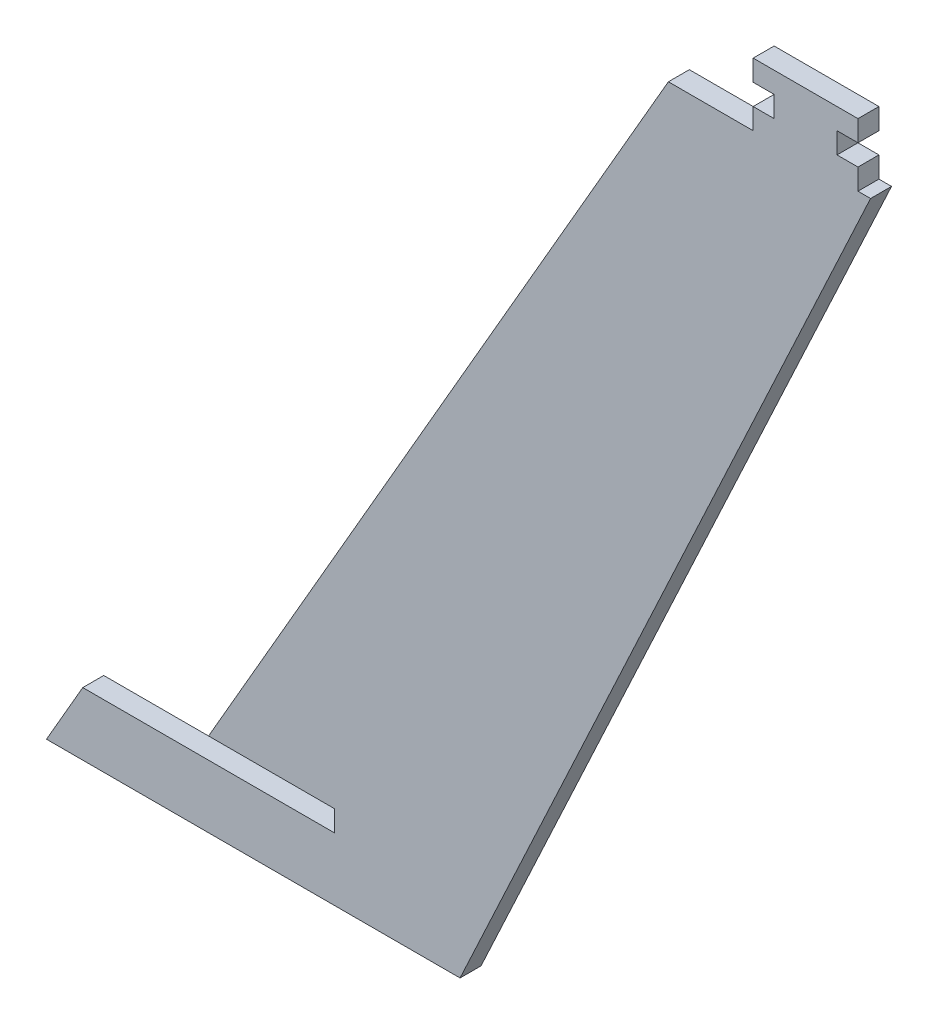
ISO-10303-21;
HEADER;
FILE_DESCRIPTION(('STEP AP214'),'2;1');
FILE_NAME('part.step','',(''),(''),'','','');
FILE_SCHEMA(('AUTOMOTIVE_DESIGN { 1 0 10303 214 1 1 1 1 }'));
ENDSEC;
DATA;
#1=APPLICATION_CONTEXT('core data for automotive mechanical design processes');
#2=APPLICATION_PROTOCOL_DEFINITION('international standard','automotive_design',2000,#1);
#3=PRODUCT_CONTEXT('',#1,'mechanical');
#4=PRODUCT('Part','Part','',(#3));
#5=PRODUCT_RELATED_PRODUCT_CATEGORY('part','',(#4));
#6=PRODUCT_DEFINITION_FORMATION('','',#4);
#7=PRODUCT_DEFINITION_CONTEXT('part definition',#1,'design');
#8=PRODUCT_DEFINITION('design','',#6,#7);
#9=PRODUCT_DEFINITION_SHAPE('','',#8);
#10=(LENGTH_UNIT() NAMED_UNIT(*) SI_UNIT(.MILLI.,.METRE.));
#11=(NAMED_UNIT(*) PLANE_ANGLE_UNIT() SI_UNIT($,.RADIAN.));
#12=(NAMED_UNIT(*) SI_UNIT($,.STERADIAN.) SOLID_ANGLE_UNIT());
#13=UNCERTAINTY_MEASURE_WITH_UNIT(LENGTH_MEASURE(1.E-05),#10,'distance_accuracy_value','');
#14=(GEOMETRIC_REPRESENTATION_CONTEXT(3) GLOBAL_UNCERTAINTY_ASSIGNED_CONTEXT((#13)) GLOBAL_UNIT_ASSIGNED_CONTEXT((#10,
#11,#12)) REPRESENTATION_CONTEXT('',''));
#15=CARTESIAN_POINT('',(0.,0.,0.));
#16=DIRECTION('',(0.,0.,1.));
#17=DIRECTION('',(1.,0.,0.));
#18=AXIS2_PLACEMENT_3D('',#15,#16,#17);
#19=CARTESIAN_POINT('',(69.919223084874,225.,-0.00100000000000013));
#20=DIRECTION('',(1.,0.,0.));
#21=DIRECTION('',(0.,0.,-1.));
#22=AXIS2_PLACEMENT_3D('',#19,#20,#21);
#23=PLANE('',#22);
#24=DIRECTION('',(0.,1.,0.));
#25=VECTOR('',#24,1.);
#26=CARTESIAN_POINT('',(69.919223084874,225.,0.));
#27=LINE('',#26,#25);
#28=CARTESIAN_POINT('',(69.919223084874,220.,0.));
#29=VERTEX_POINT('',#28);
#30=CARTESIAN_POINT('',(69.919223084874,225.,0.));
#31=VERTEX_POINT('',#30);
#32=EDGE_CURVE('E188',#29,#31,#27,.T.);
#33=ORIENTED_EDGE('',*,*,#32,.F.);
#34=DIRECTION('',(0.,0.,1.));
#35=VECTOR('',#34,1.);
#36=CARTESIAN_POINT('',(69.919223084874,220.,-0.00100000000000013));
#37=LINE('',#36,#35);
#38=CARTESIAN_POINT('',(69.919223084874,220.,5.));
#39=VERTEX_POINT('',#38);
#40=EDGE_CURVE('E172',#29,#39,#37,.T.);
#41=ORIENTED_EDGE('',*,*,#40,.T.);
#42=DIRECTION('',(0.,1.,0.));
#43=VECTOR('',#42,1.);
#44=CARTESIAN_POINT('',(69.919223084874,225.,5.));
#45=LINE('',#44,#43);
#46=CARTESIAN_POINT('',(69.919223084874,225.,5.));
#47=VERTEX_POINT('',#46);
#48=EDGE_CURVE('E200',#39,#47,#45,.T.);
#49=ORIENTED_EDGE('',*,*,#48,.T.);
#50=DIRECTION('',(0.,0.,1.));
#51=VECTOR('',#50,1.);
#52=CARTESIAN_POINT('',(69.919223084874,225.,-0.00100000000000013));
#53=LINE('',#52,#51);
#54=EDGE_CURVE('E194',#31,#47,#53,.T.);
#55=ORIENTED_EDGE('',*,*,#54,.F.);
#56=EDGE_LOOP('',(#33,#41,#49,#55));
#57=FACE_BOUND('',#56,.T.);
#58=ADVANCED_FACE('F35',(#57),#23,.F.);
#59=CARTESIAN_POINT('',(94.919223084874,225.,-0.00100000000000013));
#60=DIRECTION('',(-1.,0.,0.));
#61=DIRECTION('',(0.,0.,1.));
#62=AXIS2_PLACEMENT_3D('',#59,#60,#61);
#63=PLANE('',#62);
#64=DIRECTION('',(0.,-1.,0.));
#65=VECTOR('',#64,1.);
#66=CARTESIAN_POINT('',(94.919223084874,225.,5.));
#67=LINE('',#66,#65);
#68=CARTESIAN_POINT('',(94.919223084874,225.,5.));
#69=VERTEX_POINT('',#68);
#70=CARTESIAN_POINT('',(94.919223084874,220.,5.));
#71=VERTEX_POINT('',#70);
#72=EDGE_CURVE('E343',#69,#71,#67,.T.);
#73=ORIENTED_EDGE('',*,*,#72,.T.);
#74=DIRECTION('',(0.,0.,1.));
#75=VECTOR('',#74,1.);
#76=CARTESIAN_POINT('',(94.919223084874,220.,-0.00100000000000013));
#77=LINE('',#76,#75);
#78=CARTESIAN_POINT('',(94.919223084874,220.,0.));
#79=VERTEX_POINT('',#78);
#80=EDGE_CURVE('E330',#79,#71,#77,.T.);
#81=ORIENTED_EDGE('',*,*,#80,.F.);
#82=DIRECTION('',(0.,-1.,0.));
#83=VECTOR('',#82,1.);
#84=CARTESIAN_POINT('',(94.919223084874,225.,0.));
#85=LINE('',#84,#83);
#86=CARTESIAN_POINT('',(94.919223084874,225.,0.));
#87=VERTEX_POINT('',#86);
#88=EDGE_CURVE('E339',#87,#79,#85,.T.);
#89=ORIENTED_EDGE('',*,*,#88,.F.);
#90=DIRECTION('',(0.,0.,1.));
#91=VECTOR('',#90,1.);
#92=CARTESIAN_POINT('',(94.919223084874,225.,-0.00100000000000013));
#93=LINE('',#92,#91);
#94=EDGE_CURVE('E349',#87,#69,#93,.T.);
#95=ORIENTED_EDGE('',*,*,#94,.T.);
#96=EDGE_LOOP('',(#73,#81,#89,#95));
#97=FACE_BOUND('',#96,.T.);
#98=ADVANCED_FACE('F374',(#97),#63,.F.);
#99=CARTESIAN_POINT('',(104.919223084874,225.,5.));
#100=DIRECTION('',(-0.906307787036651,0.422618261740697,0.));
#101=DIRECTION('',(-0.422618261740697,-0.906307787036651,0.));
#102=AXIS2_PLACEMENT_3D('',#99,#100,#101);
#103=PLANE('',#102);
#104=DIRECTION('',(0.422618261740697,0.906307787036651,0.));
#105=VECTOR('',#104,1.);
#106=CARTESIAN_POINT('',(104.919223084874,225.,0.));
#107=LINE('',#106,#105);
#108=CARTESIAN_POINT('',(0.,0.,0.));
#109=VERTEX_POINT('',#108);
#110=CARTESIAN_POINT('',(97.9246082125491,210.,0.));
#111=VERTEX_POINT('',#110);
#112=EDGE_CURVE('E236',#109,#111,#107,.T.);
#113=ORIENTED_EDGE('',*,*,#112,.T.);
#114=DIRECTION('',(0.,0.,-1.));
#115=VECTOR('',#114,1.);
#116=CARTESIAN_POINT('',(97.924608212549,210.,-0.00100000000000013));
#117=LINE('',#116,#115);
#118=CARTESIAN_POINT('',(97.924608212549,210.,5.));
#119=VERTEX_POINT('',#118);
#120=EDGE_CURVE('E214',#119,#111,#117,.T.);
#121=ORIENTED_EDGE('',*,*,#120,.F.);
#122=DIRECTION('',(0.422618261740697,0.906307787036651,0.));
#123=VECTOR('',#122,1.);
#124=CARTESIAN_POINT('',(104.919223084874,225.,5.));
#125=LINE('',#124,#123);
#126=CARTESIAN_POINT('',(0.,0.,5.));
#127=VERTEX_POINT('',#126);
#128=EDGE_CURVE('E216',#127,#119,#125,.T.);
#129=ORIENTED_EDGE('',*,*,#128,.F.);
#130=DIRECTION('',(0.,0.,-1.));
#131=VECTOR('',#130,1.);
#132=CARTESIAN_POINT('',(0.,0.,5.));
#133=LINE('',#132,#131);
#134=EDGE_CURVE('E235',#127,#109,#133,.T.);
#135=ORIENTED_EDGE('',*,*,#134,.T.);
#136=EDGE_LOOP('',(#113,#121,#129,#135));
#137=FACE_BOUND('',#136,.T.);
#138=ADVANCED_FACE('F37',(#137),#103,.F.);
#139=CARTESIAN_POINT('',(58.3568051838745,225.,5.));
#140=DIRECTION('',(0.,-1.,0.));
#141=DIRECTION('',(0.,0.,-1.));
#142=AXIS2_PLACEMENT_3D('',#139,#140,#141);
#143=PLANE('',#142);
#144=DIRECTION('',(-1.,0.,0.));
#145=VECTOR('',#144,1.);
#146=CARTESIAN_POINT('',(58.3568051838745,225.,5.));
#147=LINE('',#146,#145);
#148=EDGE_CURVE('E219',#69,#47,#147,.T.);
#149=ORIENTED_EDGE('',*,*,#148,.F.);
#150=ORIENTED_EDGE('',*,*,#94,.F.);
#151=DIRECTION('',(-1.,0.,0.));
#152=VECTOR('',#151,1.);
#153=CARTESIAN_POINT('',(58.3568051838745,225.,0.));
#154=LINE('',#153,#152);
#155=EDGE_CURVE('E239',#87,#31,#154,.T.);
#156=ORIENTED_EDGE('',*,*,#155,.T.);
#157=ORIENTED_EDGE('',*,*,#54,.T.);
#158=EDGE_LOOP('',(#149,#150,#156,#157));
#159=FACE_BOUND('',#158,.T.);
#160=ADVANCED_FACE('F523',(#159),#143,.F.);
#161=CARTESIAN_POINT('',(-60.,20.,5.));
#162=DIRECTION('',(0.866025403784436,-0.500000000000004,0.));
#163=DIRECTION('',(0.500000000000004,0.866025403784436,0.));
#164=AXIS2_PLACEMENT_3D('',#161,#162,#163);
#165=PLANE('',#164);
#166=DIRECTION('',(-0.500000000000004,-0.866025403784436,0.));
#167=VECTOR('',#166,1.);
#168=CARTESIAN_POINT('',(-60.,20.,5.));
#169=LINE('',#168,#167);
#170=CARTESIAN_POINT('',(49.69655114603,210.,5.));
#171=VERTEX_POINT('',#170);
#172=CARTESIAN_POINT('',(-60.,20.,5.));
#173=VERTEX_POINT('',#172);
#174=EDGE_CURVE('E223',#171,#173,#169,.T.);
#175=ORIENTED_EDGE('',*,*,#174,.F.);
#176=DIRECTION('',(0.,0.,1.));
#177=VECTOR('',#176,1.);
#178=CARTESIAN_POINT('',(49.6965511460301,210.,-0.00100000000000013));
#179=LINE('',#178,#177);
#180=CARTESIAN_POINT('',(49.69655114603,210.,0.));
#181=VERTEX_POINT('',#180);
#182=EDGE_CURVE('E202',#181,#171,#179,.T.);
#183=ORIENTED_EDGE('',*,*,#182,.F.);
#184=DIRECTION('',(-0.500000000000004,-0.866025403784436,0.));
#185=VECTOR('',#184,1.);
#186=CARTESIAN_POINT('',(-60.,20.,0.));
#187=LINE('',#186,#185);
#188=CARTESIAN_POINT('',(-60.,20.,0.));
#189=VERTEX_POINT('',#188);
#190=EDGE_CURVE('E242',#181,#189,#187,.T.);
#191=ORIENTED_EDGE('',*,*,#190,.T.);
#192=DIRECTION('',(0.,0.,-1.));
#193=VECTOR('',#192,1.);
#194=CARTESIAN_POINT('',(-60.,20.,5.));
#195=LINE('',#194,#193);
#196=EDGE_CURVE('E11',#173,#189,#195,.T.);
#197=ORIENTED_EDGE('',*,*,#196,.F.);
#198=EDGE_LOOP('',(#175,#183,#191,#197));
#199=FACE_BOUND('',#198,.T.);
#200=ADVANCED_FACE('F294',(#199),#165,.F.);
#201=CARTESIAN_POINT('',(-30.,20.,5.));
#202=DIRECTION('',(0.,1.,0.));
#203=DIRECTION('',(-1.,0.,0.));
#204=AXIS2_PLACEMENT_3D('',#201,#202,#203);
#205=PLANE('',#204);
#206=DIRECTION('',(1.,0.,0.));
#207=VECTOR('',#206,1.);
#208=CARTESIAN_POINT('',(-30.,20.,0.));
#209=LINE('',#208,#207);
#210=CARTESIAN_POINT('',(-30.,20.,0.));
#211=VERTEX_POINT('',#210);
#212=EDGE_CURVE('E244',#189,#211,#209,.T.);
#213=ORIENTED_EDGE('',*,*,#212,.T.);
#214=DIRECTION('',(0.,0.,-1.));
#215=VECTOR('',#214,1.);
#216=CARTESIAN_POINT('',(-30.,20.,5.));
#217=LINE('',#216,#215);
#218=CARTESIAN_POINT('',(-30.,20.,5.));
#219=VERTEX_POINT('',#218);
#220=EDGE_CURVE('E43',#219,#211,#217,.T.);
#221=ORIENTED_EDGE('',*,*,#220,.F.);
#222=DIRECTION('',(1.,0.,0.));
#223=VECTOR('',#222,1.);
#224=CARTESIAN_POINT('',(-30.,20.,5.));
#225=LINE('',#224,#223);
#226=EDGE_CURVE('E225',#173,#219,#225,.T.);
#227=ORIENTED_EDGE('',*,*,#226,.F.);
#228=ORIENTED_EDGE('',*,*,#196,.T.);
#229=EDGE_LOOP('',(#213,#221,#227,#228));
#230=FACE_BOUND('',#229,.T.);
#231=ADVANCED_FACE('F292',(#230),#205,.F.);
#232=CARTESIAN_POINT('',(-30.,15.,5.));
#233=DIRECTION('',(1.,0.,0.));
#234=DIRECTION('',(0.,0.,-1.));
#235=AXIS2_PLACEMENT_3D('',#232,#233,#234);
#236=PLANE('',#235);
#237=DIRECTION('',(0.,-1.,0.));
#238=VECTOR('',#237,1.);
#239=CARTESIAN_POINT('',(-30.,15.,0.));
#240=LINE('',#239,#238);
#241=CARTESIAN_POINT('',(-30.,15.,0.));
#242=VERTEX_POINT('',#241);
#243=EDGE_CURVE('E246',#211,#242,#240,.T.);
#244=ORIENTED_EDGE('',*,*,#243,.T.);
#245=DIRECTION('',(0.,0.,-1.));
#246=VECTOR('',#245,1.);
#247=CARTESIAN_POINT('',(-30.,15.,5.));
#248=LINE('',#247,#246);
#249=CARTESIAN_POINT('',(-30.,15.,5.));
#250=VERTEX_POINT('',#249);
#251=EDGE_CURVE('E261',#250,#242,#248,.T.);
#252=ORIENTED_EDGE('',*,*,#251,.F.);
#253=DIRECTION('',(0.,-1.,0.));
#254=VECTOR('',#253,1.);
#255=CARTESIAN_POINT('',(-30.,15.,5.));
#256=LINE('',#255,#254);
#257=EDGE_CURVE('E227',#219,#250,#256,.T.);
#258=ORIENTED_EDGE('',*,*,#257,.F.);
#259=ORIENTED_EDGE('',*,*,#220,.T.);
#260=EDGE_LOOP('',(#244,#252,#258,#259));
#261=FACE_BOUND('',#260,.T.);
#262=ADVANCED_FACE('F268',(#261),#236,.F.);
#263=CARTESIAN_POINT('',(-90.,15.,5.));
#264=DIRECTION('',(0.,-1.,0.));
#265=DIRECTION('',(0.,0.,-1.));
#266=AXIS2_PLACEMENT_3D('',#263,#264,#265);
#267=PLANE('',#266);
#268=DIRECTION('',(-1.,0.,0.));
#269=VECTOR('',#268,1.);
#270=CARTESIAN_POINT('',(-90.,15.,0.));
#271=LINE('',#270,#269);
#272=CARTESIAN_POINT('',(-90.,15.,0.));
#273=VERTEX_POINT('',#272);
#274=EDGE_CURVE('E248',#242,#273,#271,.T.);
#275=ORIENTED_EDGE('',*,*,#274,.T.);
#276=DIRECTION('',(0.,0.,-1.));
#277=VECTOR('',#276,1.);
#278=CARTESIAN_POINT('',(-90.,15.,5.));
#279=LINE('',#278,#277);
#280=CARTESIAN_POINT('',(-90.,15.,5.));
#281=VERTEX_POINT('',#280);
#282=EDGE_CURVE('E258',#281,#273,#279,.T.);
#283=ORIENTED_EDGE('',*,*,#282,.F.);
#284=DIRECTION('',(-1.,0.,0.));
#285=VECTOR('',#284,1.);
#286=CARTESIAN_POINT('',(-90.,15.,5.));
#287=LINE('',#286,#285);
#288=EDGE_CURVE('E229',#250,#281,#287,.T.);
#289=ORIENTED_EDGE('',*,*,#288,.F.);
#290=ORIENTED_EDGE('',*,*,#251,.T.);
#291=EDGE_LOOP('',(#275,#283,#289,#290));
#292=FACE_BOUND('',#291,.T.);
#293=ADVANCED_FACE('F279',(#292),#267,.F.);
#294=CARTESIAN_POINT('',(-98.6602540378445,0.,5.));
#295=DIRECTION('',(0.866025403784436,-0.500000000000004,0.));
#296=DIRECTION('',(0.500000000000004,0.866025403784436,0.));
#297=AXIS2_PLACEMENT_3D('',#294,#295,#296);
#298=PLANE('',#297);
#299=DIRECTION('',(-0.500000000000004,-0.866025403784436,0.));
#300=VECTOR('',#299,1.);
#301=CARTESIAN_POINT('',(-98.6602540378445,0.,0.));
#302=LINE('',#301,#300);
#303=CARTESIAN_POINT('',(-98.6602540378445,0.,0.));
#304=VERTEX_POINT('',#303);
#305=EDGE_CURVE('E250',#273,#304,#302,.T.);
#306=ORIENTED_EDGE('',*,*,#305,.T.);
#307=DIRECTION('',(0.,0.,-1.));
#308=VECTOR('',#307,1.);
#309=CARTESIAN_POINT('',(-98.6602540378445,0.,5.));
#310=LINE('',#309,#308);
#311=CARTESIAN_POINT('',(-98.6602540378445,0.,5.));
#312=VERTEX_POINT('',#311);
#313=EDGE_CURVE('E255',#312,#304,#310,.T.);
#314=ORIENTED_EDGE('',*,*,#313,.F.);
#315=DIRECTION('',(-0.500000000000004,-0.866025403784436,0.));
#316=VECTOR('',#315,1.);
#317=CARTESIAN_POINT('',(-98.6602540378445,0.,5.));
#318=LINE('',#317,#316);
#319=EDGE_CURVE('E231',#281,#312,#318,.T.);
#320=ORIENTED_EDGE('',*,*,#319,.F.);
#321=ORIENTED_EDGE('',*,*,#282,.T.);
#322=EDGE_LOOP('',(#306,#314,#320,#321));
#323=FACE_BOUND('',#322,.T.);
#324=ADVANCED_FACE('F283',(#323),#298,.F.);
#325=CARTESIAN_POINT('',(0.,0.,5.));
#326=DIRECTION('',(0.,1.,0.));
#327=DIRECTION('',(-1.,0.,0.));
#328=AXIS2_PLACEMENT_3D('',#325,#326,#327);
#329=PLANE('',#328);
#330=DIRECTION('',(1.,0.,0.));
#331=VECTOR('',#330,1.);
#332=CARTESIAN_POINT('',(0.,0.,0.));
#333=LINE('',#332,#331);
#334=EDGE_CURVE('E220',#304,#109,#333,.T.);
#335=ORIENTED_EDGE('',*,*,#334,.T.);
#336=ORIENTED_EDGE('',*,*,#134,.F.);
#337=DIRECTION('',(1.,0.,0.));
#338=VECTOR('',#337,1.);
#339=CARTESIAN_POINT('',(0.,0.,5.));
#340=LINE('',#339,#338);
#341=EDGE_CURVE('E233',#312,#127,#340,.T.);
#342=ORIENTED_EDGE('',*,*,#341,.F.);
#343=ORIENTED_EDGE('',*,*,#313,.T.);
#344=EDGE_LOOP('',(#335,#336,#342,#343));
#345=FACE_BOUND('',#344,.T.);
#346=ADVANCED_FACE('F363',(#345),#329,.F.);
#347=CARTESIAN_POINT('',(0.,0.,5.));
#348=DIRECTION('',(0.,0.,-1.));
#349=DIRECTION('',(-1.,0.,0.));
#350=AXIS2_PLACEMENT_3D('',#347,#348,#349);
#351=PLANE('',#350);
#352=ORIENTED_EDGE('',*,*,#48,.F.);
#353=DIRECTION('',(-1.,0.,0.));
#354=VECTOR('',#353,1.);
#355=CARTESIAN_POINT('',(69.919223084874,220.,5.));
#356=LINE('',#355,#354);
#357=CARTESIAN_POINT('',(74.919223084874,220.,5.));
#358=VERTEX_POINT('',#357);
#359=EDGE_CURVE('E178',#358,#39,#356,.T.);
#360=ORIENTED_EDGE('',*,*,#359,.F.);
#361=DIRECTION('',(0.,1.,0.));
#362=VECTOR('',#361,1.);
#363=CARTESIAN_POINT('',(74.919223084874,220.,5.));
#364=LINE('',#363,#362);
#365=CARTESIAN_POINT('',(74.919223084874,215.,5.));
#366=VERTEX_POINT('',#365);
#367=EDGE_CURVE('E308',#366,#358,#364,.T.);
#368=ORIENTED_EDGE('',*,*,#367,.F.);
#369=DIRECTION('',(1.,0.,0.));
#370=VECTOR('',#369,1.);
#371=CARTESIAN_POINT('',(69.919223084874,215.,5.));
#372=LINE('',#371,#370);
#373=CARTESIAN_POINT('',(69.919223084874,215.,5.));
#374=VERTEX_POINT('',#373);
#375=EDGE_CURVE('E191',#374,#366,#372,.T.);
#376=ORIENTED_EDGE('',*,*,#375,.F.);
#377=CARTESIAN_POINT('',(69.919223084874,210.,5.));
#378=VERTEX_POINT('',#377);
#379=EDGE_CURVE('E206',#378,#374,#45,.T.);
#380=ORIENTED_EDGE('',*,*,#379,.F.);
#381=DIRECTION('',(1.,0.,0.));
#382=VECTOR('',#381,1.);
#383=CARTESIAN_POINT('',(69.919223084874,210.,5.));
#384=LINE('',#383,#382);
#385=EDGE_CURVE('E209',#171,#378,#384,.T.);
#386=ORIENTED_EDGE('',*,*,#385,.F.);
#387=ORIENTED_EDGE('',*,*,#174,.T.);
#388=ORIENTED_EDGE('',*,*,#226,.T.);
#389=ORIENTED_EDGE('',*,*,#257,.T.);
#390=ORIENTED_EDGE('',*,*,#288,.T.);
#391=ORIENTED_EDGE('',*,*,#319,.T.);
#392=ORIENTED_EDGE('',*,*,#341,.T.);
#393=ORIENTED_EDGE('',*,*,#128,.T.);
#394=DIRECTION('',(1.,0.,0.));
#395=VECTOR('',#394,1.);
#396=CARTESIAN_POINT('',(94.919223084874,210.,5.));
#397=LINE('',#396,#395);
#398=CARTESIAN_POINT('',(94.919223084874,210.,5.));
#399=VERTEX_POINT('',#398);
#400=EDGE_CURVE('E346',#399,#119,#397,.T.);
#401=ORIENTED_EDGE('',*,*,#400,.F.);
#402=CARTESIAN_POINT('',(94.919223084874,215.,5.));
#403=VERTEX_POINT('',#402);
#404=EDGE_CURVE('E342',#403,#399,#67,.T.);
#405=ORIENTED_EDGE('',*,*,#404,.F.);
#406=DIRECTION('',(1.,0.,0.));
#407=VECTOR('',#406,1.);
#408=CARTESIAN_POINT('',(89.919223084874,215.,5.));
#409=LINE('',#408,#407);
#410=CARTESIAN_POINT('',(89.919223084874,215.,5.));
#411=VERTEX_POINT('',#410);
#412=EDGE_CURVE('E58',#411,#403,#409,.T.);
#413=ORIENTED_EDGE('',*,*,#412,.F.);
#414=DIRECTION('',(0.,-1.,0.));
#415=VECTOR('',#414,1.);
#416=CARTESIAN_POINT('',(89.919223084874,220.,5.));
#417=LINE('',#416,#415);
#418=CARTESIAN_POINT('',(89.919223084874,220.,5.));
#419=VERTEX_POINT('',#418);
#420=EDGE_CURVE('E319',#419,#411,#417,.T.);
#421=ORIENTED_EDGE('',*,*,#420,.F.);
#422=DIRECTION('',(-1.,0.,0.));
#423=VECTOR('',#422,1.);
#424=CARTESIAN_POINT('',(89.919223084874,220.,5.));
#425=LINE('',#424,#423);
#426=EDGE_CURVE('E323',#71,#419,#425,.T.);
#427=ORIENTED_EDGE('',*,*,#426,.F.);
#428=ORIENTED_EDGE('',*,*,#72,.F.);
#429=ORIENTED_EDGE('',*,*,#148,.T.);
#430=EDGE_LOOP('',(#352,#360,#368,#376,#380,#386,#387,#388,#389,#390,#391,#392,#393,#401,#405,
#413,#421,#427,#428,#429));
#431=FACE_BOUND('',#430,.T.);
#432=ADVANCED_FACE('F287',(#431),#351,.F.);
#433=CARTESIAN_POINT('',(0.,0.,0.));
#434=DIRECTION('',(0.,0.,-1.));
#435=DIRECTION('',(-1.,0.,0.));
#436=AXIS2_PLACEMENT_3D('',#433,#434,#435);
#437=PLANE('',#436);
#438=DIRECTION('',(-1.,0.,0.));
#439=VECTOR('',#438,1.);
#440=CARTESIAN_POINT('',(69.919223084874,220.,0.));
#441=LINE('',#440,#439);
#442=CARTESIAN_POINT('',(74.919223084874,220.,0.));
#443=VERTEX_POINT('',#442);
#444=EDGE_CURVE('E175',#443,#29,#441,.T.);
#445=ORIENTED_EDGE('',*,*,#444,.T.);
#446=ORIENTED_EDGE('',*,*,#32,.T.);
#447=ORIENTED_EDGE('',*,*,#155,.F.);
#448=ORIENTED_EDGE('',*,*,#88,.T.);
#449=DIRECTION('',(-1.,0.,0.));
#450=VECTOR('',#449,1.);
#451=CARTESIAN_POINT('',(89.919223084874,220.,0.));
#452=LINE('',#451,#450);
#453=CARTESIAN_POINT('',(89.919223084874,220.,0.));
#454=VERTEX_POINT('',#453);
#455=EDGE_CURVE('E316',#79,#454,#452,.T.);
#456=ORIENTED_EDGE('',*,*,#455,.T.);
#457=DIRECTION('',(0.,-1.,0.));
#458=VECTOR('',#457,1.);
#459=CARTESIAN_POINT('',(89.919223084874,220.,0.));
#460=LINE('',#459,#458);
#461=CARTESIAN_POINT('',(89.919223084874,215.,0.));
#462=VERTEX_POINT('',#461);
#463=EDGE_CURVE('E313',#454,#462,#460,.T.);
#464=ORIENTED_EDGE('',*,*,#463,.T.);
#465=DIRECTION('',(1.,0.,0.));
#466=VECTOR('',#465,1.);
#467=CARTESIAN_POINT('',(89.919223084874,215.,0.));
#468=LINE('',#467,#466);
#469=CARTESIAN_POINT('',(94.919223084874,215.,0.));
#470=VERTEX_POINT('',#469);
#471=EDGE_CURVE('E329',#462,#470,#468,.T.);
#472=ORIENTED_EDGE('',*,*,#471,.T.);
#473=CARTESIAN_POINT('',(94.919223084874,210.,0.));
#474=VERTEX_POINT('',#473);
#475=EDGE_CURVE('E338',#470,#474,#85,.T.);
#476=ORIENTED_EDGE('',*,*,#475,.T.);
#477=DIRECTION('',(1.,0.,0.));
#478=VECTOR('',#477,1.);
#479=CARTESIAN_POINT('',(94.919223084874,210.,0.));
#480=LINE('',#479,#478);
#481=EDGE_CURVE('E240',#474,#111,#480,.T.);
#482=ORIENTED_EDGE('',*,*,#481,.T.);
#483=ORIENTED_EDGE('',*,*,#112,.F.);
#484=ORIENTED_EDGE('',*,*,#334,.F.);
#485=ORIENTED_EDGE('',*,*,#305,.F.);
#486=ORIENTED_EDGE('',*,*,#274,.F.);
#487=ORIENTED_EDGE('',*,*,#243,.F.);
#488=ORIENTED_EDGE('',*,*,#212,.F.);
#489=ORIENTED_EDGE('',*,*,#190,.F.);
#490=DIRECTION('',(1.,0.,0.));
#491=VECTOR('',#490,1.);
#492=CARTESIAN_POINT('',(69.919223084874,210.,0.));
#493=LINE('',#492,#491);
#494=CARTESIAN_POINT('',(69.919223084874,210.,0.));
#495=VERTEX_POINT('',#494);
#496=EDGE_CURVE('E197',#181,#495,#493,.T.);
#497=ORIENTED_EDGE('',*,*,#496,.T.);
#498=CARTESIAN_POINT('',(69.919223084874,215.,0.));
#499=VERTEX_POINT('',#498);
#500=EDGE_CURVE('E196',#495,#499,#27,.T.);
#501=ORIENTED_EDGE('',*,*,#500,.T.);
#502=DIRECTION('',(1.,0.,0.));
#503=VECTOR('',#502,1.);
#504=CARTESIAN_POINT('',(69.919223084874,215.,0.));
#505=LINE('',#504,#503);
#506=CARTESIAN_POINT('',(74.919223084874,215.,0.));
#507=VERTEX_POINT('',#506);
#508=EDGE_CURVE('E50',#499,#507,#505,.T.);
#509=ORIENTED_EDGE('',*,*,#508,.T.);
#510=DIRECTION('',(0.,1.,0.));
#511=VECTOR('',#510,1.);
#512=CARTESIAN_POINT('',(74.919223084874,220.,0.));
#513=LINE('',#512,#511);
#514=EDGE_CURVE('E190',#507,#443,#513,.T.);
#515=ORIENTED_EDGE('',*,*,#514,.T.);
#516=EDGE_LOOP('',(#445,#446,#447,#448,#456,#464,#472,#476,#482,#483,#484,#485,#486,#487,#488,
#489,#497,#501,#509,#515));
#517=FACE_BOUND('',#516,.T.);
#518=ADVANCED_FACE('F186',(#517),#437,.T.);
#519=CARTESIAN_POINT('',(69.919223084874,210.,-0.00100000000000013));
#520=DIRECTION('',(0.,-1.,0.));
#521=DIRECTION('',(0.,0.,-1.));
#522=AXIS2_PLACEMENT_3D('',#519,#520,#521);
#523=PLANE('',#522);
#524=ORIENTED_EDGE('',*,*,#182,.T.);
#525=ORIENTED_EDGE('',*,*,#385,.T.);
#526=DIRECTION('',(0.,0.,1.));
#527=VECTOR('',#526,1.);
#528=CARTESIAN_POINT('',(69.919223084874,210.,-0.00100000000000013));
#529=LINE('',#528,#527);
#530=EDGE_CURVE('E212',#495,#378,#529,.T.);
#531=ORIENTED_EDGE('',*,*,#530,.F.);
#532=ORIENTED_EDGE('',*,*,#496,.F.);
#533=EDGE_LOOP('',(#524,#525,#531,#532));
#534=FACE_BOUND('',#533,.T.);
#535=ADVANCED_FACE('F298',(#534),#523,.F.);
#536=ORIENTED_EDGE('',*,*,#379,.T.);
#537=DIRECTION('',(0.,0.,1.));
#538=VECTOR('',#537,1.);
#539=CARTESIAN_POINT('',(69.919223084874,215.,-0.00100000000000013));
#540=LINE('',#539,#538);
#541=EDGE_CURVE('E302',#499,#374,#540,.T.);
#542=ORIENTED_EDGE('',*,*,#541,.F.);
#543=ORIENTED_EDGE('',*,*,#500,.F.);
#544=ORIENTED_EDGE('',*,*,#530,.T.);
#545=EDGE_LOOP('',(#536,#542,#543,#544));
#546=FACE_BOUND('',#545,.T.);
#547=ADVANCED_FACE('F301',(#546),#23,.F.);
#548=CARTESIAN_POINT('',(94.919223084874,210.,-0.00100000000000013));
#549=DIRECTION('',(0.,-1.,0.));
#550=DIRECTION('',(0.,0.,-1.));
#551=AXIS2_PLACEMENT_3D('',#548,#549,#550);
#552=PLANE('',#551);
#553=ORIENTED_EDGE('',*,*,#120,.T.);
#554=ORIENTED_EDGE('',*,*,#481,.F.);
#555=DIRECTION('',(0.,0.,1.));
#556=VECTOR('',#555,1.);
#557=CARTESIAN_POINT('',(94.919223084874,210.,-0.00100000000000013));
#558=LINE('',#557,#556);
#559=EDGE_CURVE('E348',#474,#399,#558,.T.);
#560=ORIENTED_EDGE('',*,*,#559,.T.);
#561=ORIENTED_EDGE('',*,*,#400,.T.);
#562=EDGE_LOOP('',(#553,#554,#560,#561));
#563=FACE_BOUND('',#562,.T.);
#564=ADVANCED_FACE('F384',(#563),#552,.F.);
#565=ORIENTED_EDGE('',*,*,#475,.F.);
#566=DIRECTION('',(0.,0.,1.));
#567=VECTOR('',#566,1.);
#568=CARTESIAN_POINT('',(94.919223084874,215.,-0.00100000000000013));
#569=LINE('',#568,#567);
#570=EDGE_CURVE('E332',#470,#403,#569,.T.);
#571=ORIENTED_EDGE('',*,*,#570,.T.);
#572=ORIENTED_EDGE('',*,*,#404,.T.);
#573=ORIENTED_EDGE('',*,*,#559,.F.);
#574=EDGE_LOOP('',(#565,#571,#572,#573));
#575=FACE_BOUND('',#574,.T.);
#576=ADVANCED_FACE('F381',(#575),#63,.F.);
#577=CARTESIAN_POINT('',(89.919223084874,220.,-0.00100000000000013));
#578=DIRECTION('',(-1.,0.,0.));
#579=DIRECTION('',(0.,0.,1.));
#580=AXIS2_PLACEMENT_3D('',#577,#578,#579);
#581=PLANE('',#580);
#582=DIRECTION('',(0.,0.,1.));
#583=VECTOR('',#582,1.);
#584=CARTESIAN_POINT('',(89.919223084874,220.,-0.00100000000000013));
#585=LINE('',#584,#583);
#586=EDGE_CURVE('E327',#454,#419,#585,.T.);
#587=ORIENTED_EDGE('',*,*,#586,.T.);
#588=ORIENTED_EDGE('',*,*,#420,.T.);
#589=DIRECTION('',(0.,0.,1.));
#590=VECTOR('',#589,1.);
#591=CARTESIAN_POINT('',(89.919223084874,215.,-0.00100000000000013));
#592=LINE('',#591,#590);
#593=EDGE_CURVE('E326',#462,#411,#592,.T.);
#594=ORIENTED_EDGE('',*,*,#593,.F.);
#595=ORIENTED_EDGE('',*,*,#463,.F.);
#596=EDGE_LOOP('',(#587,#588,#594,#595));
#597=FACE_BOUND('',#596,.T.);
#598=ADVANCED_FACE('F394',(#597),#581,.F.);
#599=CARTESIAN_POINT('',(89.919223084874,220.,-0.00100000000000013));
#600=DIRECTION('',(0.,1.,0.));
#601=DIRECTION('',(0.,0.,1.));
#602=AXIS2_PLACEMENT_3D('',#599,#600,#601);
#603=PLANE('',#602);
#604=ORIENTED_EDGE('',*,*,#80,.T.);
#605=ORIENTED_EDGE('',*,*,#426,.T.);
#606=ORIENTED_EDGE('',*,*,#586,.F.);
#607=ORIENTED_EDGE('',*,*,#455,.F.);
#608=EDGE_LOOP('',(#604,#605,#606,#607));
#609=FACE_BOUND('',#608,.T.);
#610=ADVANCED_FACE('F399',(#609),#603,.F.);
#611=CARTESIAN_POINT('',(89.919223084874,215.,-0.00100000000000013));
#612=DIRECTION('',(0.,-1.,0.));
#613=DIRECTION('',(0.,0.,-1.));
#614=AXIS2_PLACEMENT_3D('',#611,#612,#613);
#615=PLANE('',#614);
#616=ORIENTED_EDGE('',*,*,#593,.T.);
#617=ORIENTED_EDGE('',*,*,#412,.T.);
#618=ORIENTED_EDGE('',*,*,#570,.F.);
#619=ORIENTED_EDGE('',*,*,#471,.F.);
#620=EDGE_LOOP('',(#616,#617,#618,#619));
#621=FACE_BOUND('',#620,.T.);
#622=ADVANCED_FACE('F401',(#621),#615,.F.);
#623=CARTESIAN_POINT('',(69.919223084874,220.,-0.00100000000000013));
#624=DIRECTION('',(0.,1.,0.));
#625=DIRECTION('',(0.,0.,1.));
#626=AXIS2_PLACEMENT_3D('',#623,#624,#625);
#627=PLANE('',#626);
#628=DIRECTION('',(0.,0.,1.));
#629=VECTOR('',#628,1.);
#630=CARTESIAN_POINT('',(74.919223084874,220.,-0.00100000000000013));
#631=LINE('',#630,#629);
#632=EDGE_CURVE('E182',#443,#358,#631,.T.);
#633=ORIENTED_EDGE('',*,*,#632,.T.);
#634=ORIENTED_EDGE('',*,*,#359,.T.);
#635=ORIENTED_EDGE('',*,*,#40,.F.);
#636=ORIENTED_EDGE('',*,*,#444,.F.);
#637=EDGE_LOOP('',(#633,#634,#635,#636));
#638=FACE_BOUND('',#637,.T.);
#639=ADVANCED_FACE('F174',(#638),#627,.F.);
#640=CARTESIAN_POINT('',(74.919223084874,220.,-0.00100000000000013));
#641=DIRECTION('',(1.,0.,0.));
#642=DIRECTION('',(0.,0.,-1.));
#643=AXIS2_PLACEMENT_3D('',#640,#641,#642);
#644=PLANE('',#643);
#645=DIRECTION('',(0.,0.,1.));
#646=VECTOR('',#645,1.);
#647=CARTESIAN_POINT('',(74.919223084874,215.,-0.00100000000000013));
#648=LINE('',#647,#646);
#649=EDGE_CURVE('E305',#507,#366,#648,.T.);
#650=ORIENTED_EDGE('',*,*,#649,.T.);
#651=ORIENTED_EDGE('',*,*,#367,.T.);
#652=ORIENTED_EDGE('',*,*,#632,.F.);
#653=ORIENTED_EDGE('',*,*,#514,.F.);
#654=EDGE_LOOP('',(#650,#651,#652,#653));
#655=FACE_BOUND('',#654,.T.);
#656=ADVANCED_FACE('F410',(#655),#644,.F.);
#657=CARTESIAN_POINT('',(69.919223084874,215.,-0.00100000000000013));
#658=DIRECTION('',(0.,-1.,0.));
#659=DIRECTION('',(0.,0.,-1.));
#660=AXIS2_PLACEMENT_3D('',#657,#658,#659);
#661=PLANE('',#660);
#662=ORIENTED_EDGE('',*,*,#541,.T.);
#663=ORIENTED_EDGE('',*,*,#375,.T.);
#664=ORIENTED_EDGE('',*,*,#649,.F.);
#665=ORIENTED_EDGE('',*,*,#508,.F.);
#666=EDGE_LOOP('',(#662,#663,#664,#665));
#667=FACE_BOUND('',#666,.T.);
#668=ADVANCED_FACE('F407',(#667),#661,.F.);
#669=CLOSED_SHELL('',(#58,#98,#138,#160,#200,#231,#262,#293,#324,#346,#432,#518,#535,#547,#564,
#576,#598,#610,#622,#639,#656,#668));
#670=MANIFOLD_SOLID_BREP('B2',#669);
#671=ADVANCED_BREP_SHAPE_REPRESENTATION('',(#18,#670),#14);
#672=SHAPE_DEFINITION_REPRESENTATION(#9,#671);
ENDSEC;
END-ISO-10303-21;
